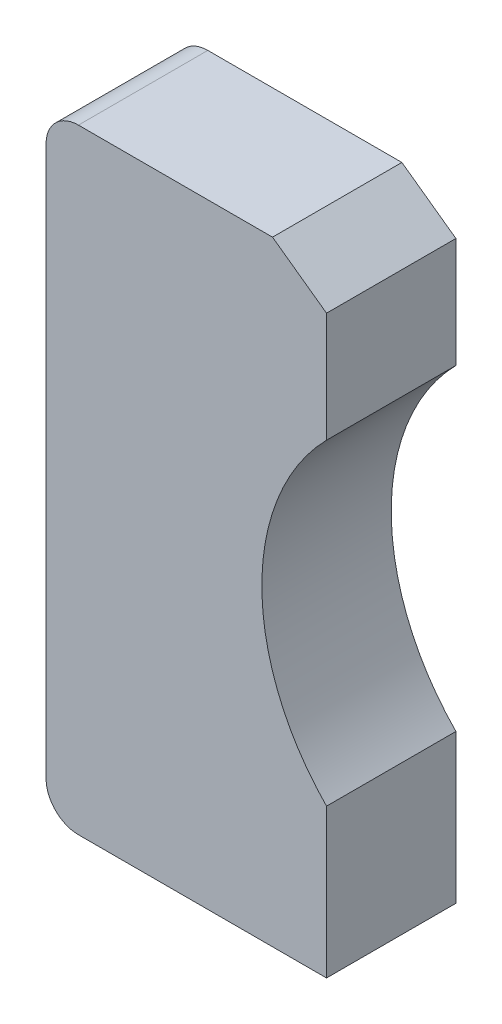
ISO-10303-21;
HEADER;
FILE_DESCRIPTION(('STEP AP214'),'2;1');
FILE_NAME('part.step','',(''),(''),'','','');
FILE_SCHEMA(('AUTOMOTIVE_DESIGN { 1 0 10303 214 1 1 1 1 }'));
ENDSEC;
DATA;
#1=APPLICATION_CONTEXT('core data for automotive mechanical design processes');
#2=APPLICATION_PROTOCOL_DEFINITION('international standard','automotive_design',2000,#1);
#3=PRODUCT_CONTEXT('',#1,'mechanical');
#4=PRODUCT('Part','Part','',(#3));
#5=PRODUCT_RELATED_PRODUCT_CATEGORY('part','',(#4));
#6=PRODUCT_DEFINITION_FORMATION('','',#4);
#7=PRODUCT_DEFINITION_CONTEXT('part definition',#1,'design');
#8=PRODUCT_DEFINITION('design','',#6,#7);
#9=PRODUCT_DEFINITION_SHAPE('','',#8);
#10=(LENGTH_UNIT() NAMED_UNIT(*) SI_UNIT(.MILLI.,.METRE.));
#11=(NAMED_UNIT(*) PLANE_ANGLE_UNIT() SI_UNIT($,.RADIAN.));
#12=(NAMED_UNIT(*) SI_UNIT($,.STERADIAN.) SOLID_ANGLE_UNIT());
#13=UNCERTAINTY_MEASURE_WITH_UNIT(LENGTH_MEASURE(1.E-05),#10,'distance_accuracy_value','');
#14=(GEOMETRIC_REPRESENTATION_CONTEXT(3) GLOBAL_UNCERTAINTY_ASSIGNED_CONTEXT((#13)) GLOBAL_UNIT_ASSIGNED_CONTEXT((#10,
#11,#12)) REPRESENTATION_CONTEXT('',''));
#15=CARTESIAN_POINT('',(0.,0.,0.));
#16=DIRECTION('',(0.,0.,1.));
#17=DIRECTION('',(1.,0.,0.));
#18=AXIS2_PLACEMENT_3D('',#15,#16,#17);
#19=CARTESIAN_POINT('',(-5.95392560124397,4.1230991353565,2.0000001857734));
#20=DIRECTION('',(0.,4.37113882867379E-08,-1.));
#21=DIRECTION('',(0.,1.,4.37113882867379E-08));
#22=AXIS2_PLACEMENT_3D('',#19,#20,#21);
#23=CYLINDRICAL_SURFACE('',#22,0.5);
#24=CARTESIAN_POINT('',(-5.95392560124397,4.12309922277927,1.85773400218636E-07));
#25=DIRECTION('',(0.,4.37113882867379E-08,-1.));
#26=DIRECTION('',(-1.,0.,0.));
#27=AXIS2_PLACEMENT_3D('',#24,#25,#26);
#28=CIRCLE('',#27,0.5);
#29=CARTESIAN_POINT('',(-6.45392560124397,4.12309922277927,1.85773400218636E-07));
#30=VERTEX_POINT('',#29);
#31=CARTESIAN_POINT('',(-5.95392560124397,4.62309922277927,2.07629094362005E-07));
#32=VERTEX_POINT('',#31);
#33=EDGE_CURVE('E11',#30,#32,#28,.T.);
#34=ORIENTED_EDGE('',*,*,#33,.F.);
#35=DIRECTION('',(0.,4.37113882867379E-08,-0.999999999999999));
#36=VECTOR('',#35,1.);
#37=CARTESIAN_POINT('',(-6.45392560124397,4.1230991353565,2.0000001857734));
#38=LINE('',#37,#36);
#39=CARTESIAN_POINT('',(-6.45392560124397,4.1230991353565,2.0000001857734));
#40=VERTEX_POINT('',#39);
#41=EDGE_CURVE('E24',#40,#30,#38,.T.);
#42=ORIENTED_EDGE('',*,*,#41,.F.);
#43=CARTESIAN_POINT('',(-5.95392560124397,4.1230991353565,2.0000001857734));
#44=DIRECTION('',(0.,4.37113882867379E-08,-1.));
#45=DIRECTION('',(-1.,0.,0.));
#46=AXIS2_PLACEMENT_3D('',#43,#44,#45);
#47=CIRCLE('',#46,0.5);
#48=CARTESIAN_POINT('',(-5.95392560124397,4.6230991353565,2.00000020762909));
#49=VERTEX_POINT('',#48);
#50=EDGE_CURVE('E156',#40,#49,#47,.T.);
#51=ORIENTED_EDGE('',*,*,#50,.T.);
#52=DIRECTION('',(0.,4.37113882867379E-08,-0.999999999999999));
#53=VECTOR('',#52,1.);
#54=CARTESIAN_POINT('',(-5.95392560124397,4.6230991353565,2.00000020762909));
#55=LINE('',#54,#53);
#56=EDGE_CURVE('E101',#49,#32,#55,.T.);
#57=ORIENTED_EDGE('',*,*,#56,.T.);
#58=EDGE_LOOP('',(#34,#42,#51,#57));
#59=FACE_BOUND('',#58,.T.);
#60=ADVANCED_FACE('F17',(#59),#23,.T.);
#61=CARTESIAN_POINT('',(-6.45392560124397,-0.126900864643503,2.));
#62=DIRECTION('',(-1.,0.,0.));
#63=DIRECTION('',(0.,-1.,-4.37113882867379E-08));
#64=AXIS2_PLACEMENT_3D('',#61,#62,#63);
#65=PLANE('',#64);
#66=ORIENTED_EDGE('',*,*,#41,.T.);
#67=DIRECTION('',(0.,0.999999999999999,4.37113882867379E-08));
#68=VECTOR('',#67,1.);
#69=CARTESIAN_POINT('',(-6.45392560124397,-4.37690077722073,-1.85773400218636E-07));
#70=LINE('',#69,#68);
#71=CARTESIAN_POINT('',(-6.45392560124397,-4.37690077722073,-1.85773400218636E-07));
#72=VERTEX_POINT('',#71);
#73=EDGE_CURVE('E158',#72,#30,#70,.T.);
#74=ORIENTED_EDGE('',*,*,#73,.F.);
#75=DIRECTION('',(0.,4.37113882867379E-08,-0.999999999999999));
#76=VECTOR('',#75,1.);
#77=CARTESIAN_POINT('',(-6.45392560124397,-4.3769008646435,1.9999998142266));
#78=LINE('',#77,#76);
#79=CARTESIAN_POINT('',(-6.45392560124397,-4.3769008646435,1.9999998142266));
#80=VERTEX_POINT('',#79);
#81=EDGE_CURVE('E148',#80,#72,#78,.T.);
#82=ORIENTED_EDGE('',*,*,#81,.F.);
#83=DIRECTION('',(0.,0.999999999999999,4.37113882867379E-08));
#84=VECTOR('',#83,1.);
#85=CARTESIAN_POINT('',(-6.45392560124397,-4.3769008646435,1.9999998142266));
#86=LINE('',#85,#84);
#87=EDGE_CURVE('E136',#80,#40,#86,.T.);
#88=ORIENTED_EDGE('',*,*,#87,.T.);
#89=EDGE_LOOP('',(#66,#74,#82,#88));
#90=FACE_BOUND('',#89,.T.);
#91=ADVANCED_FACE('F163',(#90),#65,.T.);
#92=CARTESIAN_POINT('',(-5.95392560124397,-4.3769008646435,1.9999998142266));
#93=DIRECTION('',(0.,4.37113882867379E-08,-1.));
#94=DIRECTION('',(0.,1.,4.37113882867379E-08));
#95=AXIS2_PLACEMENT_3D('',#92,#93,#94);
#96=CYLINDRICAL_SURFACE('',#95,0.5);
#97=CARTESIAN_POINT('',(-5.95392560124397,-4.37690077722073,-1.85773400218636E-07));
#98=DIRECTION('',(0.,-4.37113882867379E-08,1.));
#99=DIRECTION('',(-1.,0.,0.));
#100=AXIS2_PLACEMENT_3D('',#97,#98,#99);
#101=CIRCLE('',#100,0.5);
#102=CARTESIAN_POINT('',(-5.95392560124397,-4.87690077722073,-2.07629094362005E-07));
#103=VERTEX_POINT('',#102);
#104=EDGE_CURVE('E161',#72,#103,#101,.T.);
#105=ORIENTED_EDGE('',*,*,#104,.T.);
#106=DIRECTION('',(0.,4.37113882867379E-08,-0.999999999999999));
#107=VECTOR('',#106,1.);
#108=CARTESIAN_POINT('',(-5.95392560124397,-4.8769008646435,1.99999979237091));
#109=LINE('',#108,#107);
#110=CARTESIAN_POINT('',(-5.95392560124397,-4.8769008646435,1.99999979237091));
#111=VERTEX_POINT('',#110);
#112=EDGE_CURVE('E151',#111,#103,#109,.T.);
#113=ORIENTED_EDGE('',*,*,#112,.F.);
#114=CARTESIAN_POINT('',(-5.95392560124397,-4.3769008646435,1.9999998142266));
#115=DIRECTION('',(0.,-4.37113882867379E-08,1.));
#116=DIRECTION('',(-1.,0.,0.));
#117=AXIS2_PLACEMENT_3D('',#114,#115,#116);
#118=CIRCLE('',#117,0.5);
#119=EDGE_CURVE('E138',#80,#111,#118,.T.);
#120=ORIENTED_EDGE('',*,*,#119,.F.);
#121=ORIENTED_EDGE('',*,*,#81,.T.);
#122=EDGE_LOOP('',(#105,#113,#120,#121));
#123=FACE_BOUND('',#122,.T.);
#124=ADVANCED_FACE('F170',(#123),#96,.T.);
#125=CARTESIAN_POINT('',(0.381074398756027,-4.8769008646435,1.99999979237091));
#126=DIRECTION('',(0.,1.,4.37113882867379E-08));
#127=DIRECTION('',(-1.,0.,0.));
#128=AXIS2_PLACEMENT_3D('',#125,#126,#127);
#129=PLANE('',#128);
#130=DIRECTION('',(1.,0.,0.));
#131=VECTOR('',#130,1.);
#132=CARTESIAN_POINT('',(-5.95392560124397,-4.87690077722073,-2.07629094362005E-07));
#133=LINE('',#132,#131);
#134=CARTESIAN_POINT('',(-2.11892560124397,-4.87690077722073,-2.07629094362005E-07));
#135=VERTEX_POINT('',#134);
#136=EDGE_CURVE('E154',#103,#135,#133,.T.);
#137=ORIENTED_EDGE('',*,*,#136,.T.);
#138=DIRECTION('',(0.,4.37113882867379E-08,-0.999999999999999));
#139=VECTOR('',#138,1.);
#140=CARTESIAN_POINT('',(-2.11892560124397,-4.8769008646435,1.99999979237091));
#141=LINE('',#140,#139);
#142=CARTESIAN_POINT('',(-2.11892560124397,-4.8769008646435,1.99999979237091));
#143=VERTEX_POINT('',#142);
#144=EDGE_CURVE('E141',#143,#135,#141,.T.);
#145=ORIENTED_EDGE('',*,*,#144,.F.);
#146=DIRECTION('',(1.,0.,0.));
#147=VECTOR('',#146,1.);
#148=CARTESIAN_POINT('',(-5.95392560124397,-4.87690086464351,1.99999979237091));
#149=LINE('',#148,#147);
#150=EDGE_CURVE('E127',#111,#143,#149,.T.);
#151=ORIENTED_EDGE('',*,*,#150,.F.);
#152=ORIENTED_EDGE('',*,*,#112,.T.);
#153=EDGE_LOOP('',(#137,#145,#151,#152));
#154=FACE_BOUND('',#153,.T.);
#155=ADVANCED_FACE('F174',(#154),#129,.F.);
#156=CARTESIAN_POINT('',(-2.11892560124397,-0.126900864643503,2.));
#157=DIRECTION('',(1.,0.,0.));
#158=DIRECTION('',(0.,1.,4.37113882867379E-08));
#159=AXIS2_PLACEMENT_3D('',#156,#157,#158);
#160=PLANE('',#159);
#161=DIRECTION('',(0.,-0.999999999999999,-4.37113882867379E-08));
#162=VECTOR('',#161,1.);
#163=CARTESIAN_POINT('',(-2.11892560124397,-2.57639052000373,-1.0707059725117E-07));
#164=LINE('',#163,#162);
#165=CARTESIAN_POINT('',(-2.11892560124397,-2.57639052000373,-1.0707059725117E-07));
#166=VERTEX_POINT('',#165);
#167=EDGE_CURVE('E144',#166,#135,#164,.T.);
#168=ORIENTED_EDGE('',*,*,#167,.F.);
#169=DIRECTION('',(0.,4.37113882867379E-08,-0.999999999999999));
#170=VECTOR('',#169,1.);
#171=CARTESIAN_POINT('',(-2.11892560124397,-2.5763906074265,1.9999998929294));
#172=LINE('',#171,#170);
#173=CARTESIAN_POINT('',(-2.11892560124397,-2.5763906074265,1.9999998929294));
#174=VERTEX_POINT('',#173);
#175=EDGE_CURVE('E130',#174,#166,#172,.T.);
#176=ORIENTED_EDGE('',*,*,#175,.F.);
#177=DIRECTION('',(0.,-0.999999999999999,-4.37113882754165E-08));
#178=VECTOR('',#177,1.);
#179=CARTESIAN_POINT('',(-2.11892560124397,-2.5763906074265,1.9999998929294));
#180=LINE('',#179,#178);
#181=EDGE_CURVE('E118',#174,#143,#180,.T.);
#182=ORIENTED_EDGE('',*,*,#181,.T.);
#183=ORIENTED_EDGE('',*,*,#144,.T.);
#184=EDGE_LOOP('',(#168,#176,#182,#183));
#185=FACE_BOUND('',#184,.T.);
#186=ADVANCED_FACE('F181',(#185),#160,.T.);
#187=CARTESIAN_POINT('',(0.381074398756024,-0.126900864643503,2.));
#188=DIRECTION('',(0.,4.37113882867379E-08,-1.));
#189=DIRECTION('',(0.,1.,4.37113882867379E-08));
#190=AXIS2_PLACEMENT_3D('',#187,#188,#189);
#191=CYLINDRICAL_SURFACE('',#190,3.5);
#192=CARTESIAN_POINT('',(0.381074398756024,-0.126900777220726,0.));
#193=DIRECTION('',(0.,-4.37113882867379E-08,1.));
#194=DIRECTION('',(-0.714285714285739,0.69985421222374,3.0591599214621E-08));
#195=AXIS2_PLACEMENT_3D('',#192,#193,#194);
#196=CIRCLE('',#195,3.5);
#197=CARTESIAN_POINT('',(-2.11892560124397,2.32258896556227,1.0707059725117E-07));
#198=VERTEX_POINT('',#197);
#199=EDGE_CURVE('E133',#198,#166,#196,.T.);
#200=ORIENTED_EDGE('',*,*,#199,.F.);
#201=DIRECTION('',(0.,4.37113882867379E-08,-0.999999999999999));
#202=VECTOR('',#201,1.);
#203=CARTESIAN_POINT('',(-2.11892560124397,2.3225888781395,2.0000001070706));
#204=LINE('',#203,#202);
#205=CARTESIAN_POINT('',(-2.11892560124397,2.3225888781395,2.0000001070706));
#206=VERTEX_POINT('',#205);
#207=EDGE_CURVE('E121',#206,#198,#204,.T.);
#208=ORIENTED_EDGE('',*,*,#207,.F.);
#209=CARTESIAN_POINT('',(0.381074398756024,-0.126900864643503,2.));
#210=DIRECTION('',(0.,-4.37113882867379E-08,1.));
#211=DIRECTION('',(-0.714285714285739,0.69985421222374,3.0591599214621E-08));
#212=AXIS2_PLACEMENT_3D('',#209,#210,#211);
#213=CIRCLE('',#212,3.5);
#214=EDGE_CURVE('E112',#206,#174,#213,.T.);
#215=ORIENTED_EDGE('',*,*,#214,.T.);
#216=ORIENTED_EDGE('',*,*,#175,.T.);
#217=EDGE_LOOP('',(#200,#208,#215,#216));
#218=FACE_BOUND('',#217,.T.);
#219=ADVANCED_FACE('F179',(#218),#191,.F.);
#220=CARTESIAN_POINT('',(-2.11892560124397,-0.126900864643503,2.));
#221=DIRECTION('',(1.,0.,0.));
#222=DIRECTION('',(0.,1.,4.37113882867379E-08));
#223=AXIS2_PLACEMENT_3D('',#220,#221,#222);
#224=PLANE('',#223);
#225=DIRECTION('',(0.,-0.999999999999999,-4.37113882867379E-08));
#226=VECTOR('',#225,1.);
#227=CARTESIAN_POINT('',(-2.11892560124397,4.02309922277927,1.81402261389962E-07));
#228=LINE('',#227,#226);
#229=CARTESIAN_POINT('',(-2.11892560124397,4.02309922277927,1.81402261389962E-07));
#230=VERTEX_POINT('',#229);
#231=EDGE_CURVE('E124',#230,#198,#228,.T.);
#232=ORIENTED_EDGE('',*,*,#231,.F.);
#233=DIRECTION('',(0.,4.37113882867379E-08,-0.999999999999999));
#234=VECTOR('',#233,1.);
#235=CARTESIAN_POINT('',(-2.11892560124397,4.0230991353565,2.00000018140226));
#236=LINE('',#235,#234);
#237=CARTESIAN_POINT('',(-2.11892560124397,4.0230991353565,2.00000018140226));
#238=VERTEX_POINT('',#237);
#239=EDGE_CURVE('E115',#238,#230,#236,.T.);
#240=ORIENTED_EDGE('',*,*,#239,.F.);
#241=DIRECTION('',(0.,-0.999999999999999,-4.37113881669616E-08));
#242=VECTOR('',#241,1.);
#243=CARTESIAN_POINT('',(-2.11892560124397,4.0230991353565,2.00000018140226));
#244=LINE('',#243,#242);
#245=EDGE_CURVE('E95',#238,#206,#244,.T.);
#246=ORIENTED_EDGE('',*,*,#245,.T.);
#247=ORIENTED_EDGE('',*,*,#207,.T.);
#248=EDGE_LOOP('',(#232,#240,#246,#247));
#249=FACE_BOUND('',#248,.T.);
#250=ADVANCED_FACE('F177',(#249),#224,.T.);
#251=CARTESIAN_POINT('',(1.49639989711303,1.4252604539025,2.00000006784713));
#252=DIRECTION('',(0.583535844379755,0.812087383428659,3.54974669398112E-08));
#253=DIRECTION('',(-0.812087383428659,0.583535844379755,2.5507161872913E-08));
#254=AXIS2_PLACEMENT_3D('',#251,#252,#253);
#255=PLANE('',#254);
#256=DIRECTION('',(0.812087383428658,-0.583535844379756,-2.5507161872913E-08));
#257=VECTOR('',#256,1.);
#258=CARTESIAN_POINT('',(-2.95392560124422,4.62309922277893,2.0762909436199E-07));
#259=LINE('',#258,#257);
#260=CARTESIAN_POINT('',(-2.95392560124397,4.62309922277927,2.07629094362005E-07));
#261=VERTEX_POINT('',#260);
#262=EDGE_CURVE('E90',#261,#230,#259,.T.);
#263=ORIENTED_EDGE('',*,*,#262,.F.);
#264=DIRECTION('',(0.,4.37113882867379E-08,-0.999999999999999));
#265=VECTOR('',#264,1.);
#266=CARTESIAN_POINT('',(-2.95392560124397,4.6230991353565,2.00000020762909));
#267=LINE('',#266,#265);
#268=CARTESIAN_POINT('',(-2.95392560124397,4.6230991353565,2.00000020762909));
#269=VERTEX_POINT('',#268);
#270=EDGE_CURVE('E82',#269,#261,#267,.T.);
#271=ORIENTED_EDGE('',*,*,#270,.F.);
#272=DIRECTION('',(0.812087383428658,-0.583535844379756,-2.55071620456777E-08));
#273=VECTOR('',#272,1.);
#274=CARTESIAN_POINT('',(-2.95392560124422,4.62309913535615,2.00000020762909));
#275=LINE('',#274,#273);
#276=EDGE_CURVE('E87',#269,#238,#275,.T.);
#277=ORIENTED_EDGE('',*,*,#276,.T.);
#278=ORIENTED_EDGE('',*,*,#239,.T.);
#279=EDGE_LOOP('',(#263,#271,#277,#278));
#280=FACE_BOUND('',#279,.T.);
#281=ADVANCED_FACE('F84',(#280),#255,.T.);
#282=CARTESIAN_POINT('',(0.381074398756027,4.6230991353565,2.00000020762909));
#283=DIRECTION('',(0.,1.,4.37113882867379E-08));
#284=DIRECTION('',(-1.,0.,0.));
#285=AXIS2_PLACEMENT_3D('',#282,#283,#284);
#286=PLANE('',#285);
#287=DIRECTION('',(1.,0.,0.));
#288=VECTOR('',#287,1.);
#289=CARTESIAN_POINT('',(-5.95392560124397,4.62309922277927,2.07629094362005E-07));
#290=LINE('',#289,#288);
#291=EDGE_CURVE('E94',#32,#261,#290,.T.);
#292=ORIENTED_EDGE('',*,*,#291,.F.);
#293=ORIENTED_EDGE('',*,*,#56,.F.);
#294=DIRECTION('',(1.,0.,0.));
#295=VECTOR('',#294,1.);
#296=CARTESIAN_POINT('',(-5.95392560124397,4.62309913535649,2.00000020762909));
#297=LINE('',#296,#295);
#298=EDGE_CURVE('E99',#49,#269,#297,.T.);
#299=ORIENTED_EDGE('',*,*,#298,.T.);
#300=ORIENTED_EDGE('',*,*,#270,.T.);
#301=EDGE_LOOP('',(#292,#293,#299,#300));
#302=FACE_BOUND('',#301,.T.);
#303=ADVANCED_FACE('F100',(#302),#286,.T.);
#304=CARTESIAN_POINT('',(0.381074398756027,-0.126900864643503,2.));
#305=DIRECTION('',(0.,-4.37113882867379E-08,1.));
#306=DIRECTION('',(0.,-1.,-4.37113882867379E-08));
#307=AXIS2_PLACEMENT_3D('',#304,#305,#306);
#308=PLANE('',#307);
#309=ORIENTED_EDGE('',*,*,#50,.F.);
#310=ORIENTED_EDGE('',*,*,#87,.F.);
#311=ORIENTED_EDGE('',*,*,#119,.T.);
#312=ORIENTED_EDGE('',*,*,#150,.T.);
#313=ORIENTED_EDGE('',*,*,#181,.F.);
#314=ORIENTED_EDGE('',*,*,#214,.F.);
#315=ORIENTED_EDGE('',*,*,#245,.F.);
#316=ORIENTED_EDGE('',*,*,#276,.F.);
#317=ORIENTED_EDGE('',*,*,#298,.F.);
#318=EDGE_LOOP('',(#309,#310,#311,#312,#313,#314,#315,#316,#317));
#319=FACE_BOUND('',#318,.T.);
#320=ADVANCED_FACE('F105',(#319),#308,.T.);
#321=CARTESIAN_POINT('',(0.381074398756027,-0.126900777220726,0.));
#322=DIRECTION('',(0.,-4.37113882867379E-08,1.));
#323=DIRECTION('',(0.,-1.,-4.37113882867379E-08));
#324=AXIS2_PLACEMENT_3D('',#321,#322,#323);
#325=PLANE('',#324);
#326=ORIENTED_EDGE('',*,*,#33,.T.);
#327=ORIENTED_EDGE('',*,*,#291,.T.);
#328=ORIENTED_EDGE('',*,*,#262,.T.);
#329=ORIENTED_EDGE('',*,*,#231,.T.);
#330=ORIENTED_EDGE('',*,*,#199,.T.);
#331=ORIENTED_EDGE('',*,*,#167,.T.);
#332=ORIENTED_EDGE('',*,*,#136,.F.);
#333=ORIENTED_EDGE('',*,*,#104,.F.);
#334=ORIENTED_EDGE('',*,*,#73,.T.);
#335=EDGE_LOOP('',(#326,#327,#328,#329,#330,#331,#332,#333,#334));
#336=FACE_BOUND('',#335,.T.);
#337=ADVANCED_FACE('F167',(#336),#325,.F.);
#338=CLOSED_SHELL('',(#60,#91,#124,#155,#186,#219,#250,#281,#303,#320,#337));
#339=MANIFOLD_SOLID_BREP('B1',#338);
#340=ADVANCED_BREP_SHAPE_REPRESENTATION('',(#18,#339),#14);
#341=SHAPE_DEFINITION_REPRESENTATION(#9,#340);
ENDSEC;
END-ISO-10303-21;
